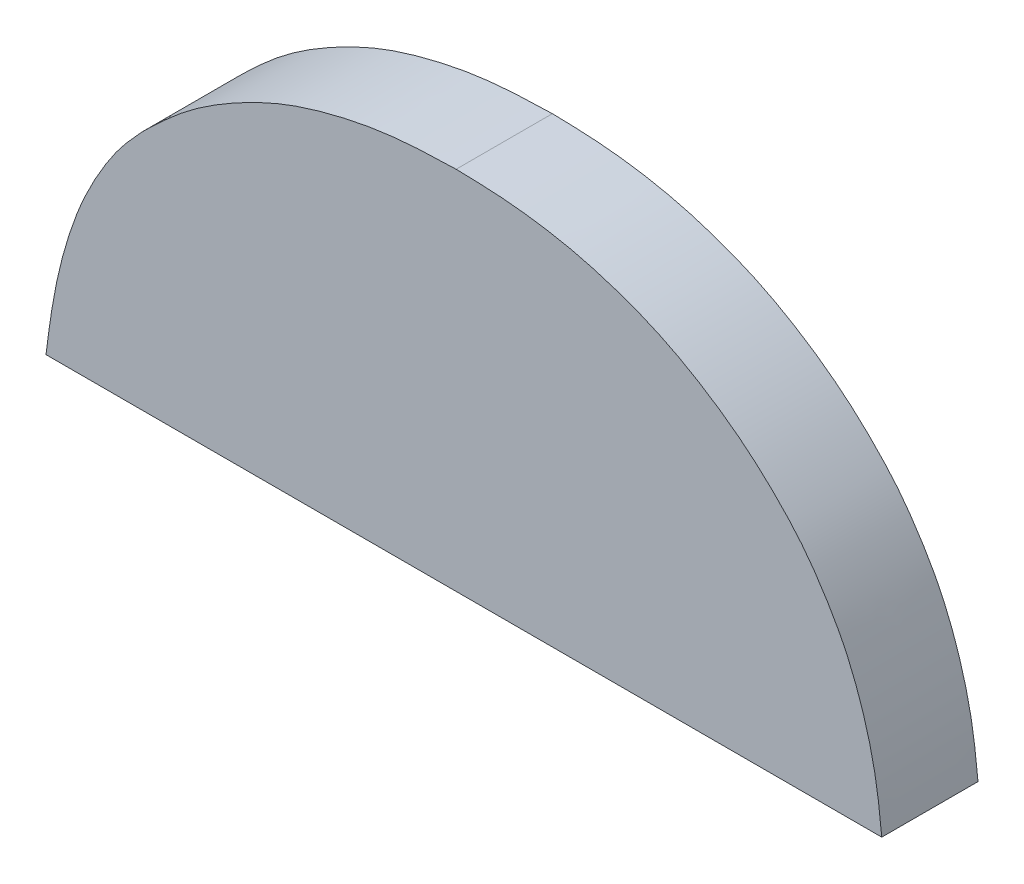
ISO-10303-21;
HEADER;
FILE_DESCRIPTION(('STEP AP214'),'2;1');
FILE_NAME('part.step','',(''),(''),'','','');
FILE_SCHEMA(('AUTOMOTIVE_DESIGN { 1 0 10303 214 1 1 1 1 }'));
ENDSEC;
DATA;
#1=APPLICATION_CONTEXT('core data for automotive mechanical design processes');
#2=APPLICATION_PROTOCOL_DEFINITION('international standard','automotive_design',2000,#1);
#3=PRODUCT_CONTEXT('',#1,'mechanical');
#4=PRODUCT('Part','Part','',(#3));
#5=PRODUCT_RELATED_PRODUCT_CATEGORY('part','',(#4));
#6=PRODUCT_DEFINITION_FORMATION('','',#4);
#7=PRODUCT_DEFINITION_CONTEXT('part definition',#1,'design');
#8=PRODUCT_DEFINITION('design','',#6,#7);
#9=PRODUCT_DEFINITION_SHAPE('','',#8);
#10=(LENGTH_UNIT() NAMED_UNIT(*) SI_UNIT(.MILLI.,.METRE.));
#11=(NAMED_UNIT(*) PLANE_ANGLE_UNIT() SI_UNIT($,.RADIAN.));
#12=(NAMED_UNIT(*) SI_UNIT($,.STERADIAN.) SOLID_ANGLE_UNIT());
#13=UNCERTAINTY_MEASURE_WITH_UNIT(LENGTH_MEASURE(1.E-05),#10,'distance_accuracy_value','');
#14=(GEOMETRIC_REPRESENTATION_CONTEXT(3) GLOBAL_UNCERTAINTY_ASSIGNED_CONTEXT((#13)) GLOBAL_UNIT_ASSIGNED_CONTEXT((#10,
#11,#12)) REPRESENTATION_CONTEXT('',''));
#15=CARTESIAN_POINT('',(0.,0.,0.));
#16=DIRECTION('',(0.,0.,1.));
#17=DIRECTION('',(1.,0.,0.));
#18=AXIS2_PLACEMENT_3D('',#15,#16,#17);
#19=CARTESIAN_POINT('',(-12.3042138671329,-1.03740541843096,-11.6632275560423));
#20=DIRECTION('',(0.,0.,1.));
#21=DIRECTION('',(0.,-1.,0.));
#22=AXIS2_PLACEMENT_3D('',#19,#20,#21);
#23=PLANE('',#22);
#24=DIRECTION('',(1.,0.,0.));
#25=VECTOR('',#24,1.);
#26=CARTESIAN_POINT('',(16.797592930269,-9.86319278697722,-11.6632275560423));
#27=LINE('',#26,#25);
#28=CARTESIAN_POINT('',(16.3460373747135,-9.86319278697722,-11.6632275560423));
#29=VERTEX_POINT('',#28);
#30=CARTESIAN_POINT('',(16.797592930269,-9.86319278697722,-11.6632275560423));
#31=VERTEX_POINT('',#30);
#32=EDGE_CURVE('E75',#29,#31,#27,.T.);
#33=ORIENTED_EDGE('',*,*,#32,.F.);
#34=CARTESIAN_POINT('',(16.3978516108246,-9.73310598142167,-11.6632275560423));
#35=CARTESIAN_POINT('',(16.3963477541903,-9.7347312519197,-11.6632275560423));
#36=CARTESIAN_POINT('',(16.3948403947072,-9.73635573284047,-11.6632275560423));
#37=CARTESIAN_POINT('',(16.3918687679316,-9.73964402485632,-11.6632275560423));
#38=CARTESIAN_POINT('',(16.3904045118469,-9.74130784598148,-11.6632275560423));
#39=CARTESIAN_POINT('',(16.3875725590429,-9.74471187617953,-11.6632275560423));
#40=CARTESIAN_POINT('',(16.3862046938479,-9.74645194289279,-11.6632275560423));
#41=CARTESIAN_POINT('',(16.3835689846794,-9.75000502055491,-11.6632275560423));
#42=CARTESIAN_POINT('',(16.3823011233229,-9.75181801874349,-11.6632275560423));
#43=CARTESIAN_POINT('',(16.3786402734566,-9.75729142783062,-11.6632275560423));
#44=CARTESIAN_POINT('',(16.3763583095054,-9.76102612217782,-11.6632275560423));
#45=CARTESIAN_POINT('',(16.3720515573308,-9.76864186706529,-11.6632275560423));
#46=CARTESIAN_POINT('',(16.3700268915956,-9.77252298618013,-11.6632275560423));
#47=CARTESIAN_POINT('',(16.365458035365,-9.78210313091849,-11.6632275560423));
#48=CARTESIAN_POINT('',(16.3630596632237,-9.78787261570379,-11.6632275560423));
#49=CARTESIAN_POINT('',(16.3588092982735,-9.79962760072538,-11.6632275560423));
#50=CARTESIAN_POINT('',(16.3569592284269,-9.80561378048643,-11.6632275560423));
#51=CARTESIAN_POINT('',(16.3541773372674,-9.81588688788045,-11.6632275560423));
#52=CARTESIAN_POINT('',(16.3531365091645,-9.82014521551532,-11.6632275560423));
#53=CARTESIAN_POINT('',(16.3512702106005,-9.82871041048724,-11.6632275560423));
#54=CARTESIAN_POINT('',(16.3504448028145,-9.8330172915712,-11.6632275560423));
#55=CARTESIAN_POINT('',(16.3489745698201,-9.84163103755771,-11.6632275560423));
#56=CARTESIAN_POINT('',(16.3483285821742,-9.84593771275958,-11.6632275560423));
#57=CARTESIAN_POINT('',(16.3471316269152,-9.85456077029746,-11.6632275560423));
#58=CARTESIAN_POINT('',(16.3465805781416,-9.85887714111453,-11.6632275560423));
#59=CARTESIAN_POINT('',(16.3460373747135,-9.86319278697722,-11.6632275560423));
#60=B_SPLINE_CURVE_WITH_KNOTS('',3,(#34,#35,#36,#37,#38,#39,#40,#41,#42,#43,#44,#45,#46,#47,#48,
#49,#50,#51,#52,#53,#54,#55,#56,#57,#58,#59),.UNSPECIFIED.,.F.,.F.,(4,2,2,2,2,2,2,2,2,2,2,2,4),
(0.,0.00664602968424741,0.0132937724962099,0.0199295921017872,0.0265642556925554,
0.0396812964362255,0.0528045584070677,0.0715151462265396,0.0902905982214406,0.103437192459347,
0.116587607347878,0.129650722007691,0.142702613389242),.UNSPECIFIED.);
#61=CARTESIAN_POINT('',(16.3978516108246,-9.73310598142167,-11.6632275560423));
#62=VERTEX_POINT('',#61);
#63=EDGE_CURVE('E67',#62,#29,#60,.T.);
#64=ORIENTED_EDGE('',*,*,#63,.F.);
#65=CARTESIAN_POINT('',(16.5676259163802,-9.66563723142166,-11.6632275560423));
#66=CARTESIAN_POINT('',(16.5632939716138,-9.66575048688524,-11.6632275560423));
#67=CARTESIAN_POINT('',(16.5589588774559,-9.66586469649818,-11.6632275560423));
#68=CARTESIAN_POINT('',(16.5502926464841,-9.66620584877957,-11.6632275560423));
#69=CARTESIAN_POINT('',(16.5459615107615,-9.6664328164518,-11.6632275560423));
#70=CARTESIAN_POINT('',(16.5372941710684,-9.66711202007369,-11.6632275560423));
#71=CARTESIAN_POINT('',(16.5329580465197,-9.66756535597326,-11.6632275560423));
#72=CARTESIAN_POINT('',(16.5243160480859,-9.66870745748117,-11.6632275560423));
#73=CARTESIAN_POINT('',(16.520010179235,-9.669396261365,-11.6632275560423));
#74=CARTESIAN_POINT('',(16.5095751988507,-9.67137681839585,-11.6632275560423));
#75=CARTESIAN_POINT('',(16.5034714299209,-9.67280052008504,-11.6632275560423));
#76=CARTESIAN_POINT('',(16.4913671415097,-9.6760369098774,-11.6632275560423));
#77=CARTESIAN_POINT('',(16.4853666092723,-9.67784954954501,-11.6632275560423));
#78=CARTESIAN_POINT('',(16.4677186640605,-9.6841877594558,-11.6632275560423));
#79=CARTESIAN_POINT('',(16.4563870507469,-9.68961902132921,-11.6632275560423));
#80=CARTESIAN_POINT('',(16.4411398402014,-9.69832006290796,-11.6632275560423));
#81=CARTESIAN_POINT('',(16.4368251208508,-9.70095189376335,-11.6632275560423));
#82=CARTESIAN_POINT('',(16.4284162934384,-9.70655379094297,-11.6632275560423));
#83=CARTESIAN_POINT('',(16.4243220577372,-9.70952365840638,-11.6632275560423));
#84=CARTESIAN_POINT('',(16.4164005906203,-9.71581977734417,-11.6632275560423));
#85=CARTESIAN_POINT('',(16.4125743124433,-9.71914720401966,-11.6632275560423));
#86=CARTESIAN_POINT('',(16.4051014614518,-9.72600870628252,-11.6632275560423));
#87=CARTESIAN_POINT('',(16.4014551001009,-9.72954301484333,-11.6632275560423));
#88=CARTESIAN_POINT('',(16.3978516108246,-9.73310598142167,-11.6632275560423));
#89=B_SPLINE_CURVE_WITH_KNOTS('',3,(#65,#66,#67,#68,#69,#70,#71,#72,#73,#74,#75,#76,#77,#78,#79,
#80,#81,#82,#83,#84,#85,#86,#87,#88),.UNSPECIFIED.,.F.,.F.,(4,2,2,2,2,2,2,2,2,2,2,4),(0.,
0.0130057656904838,0.0260144166613628,0.0390869024561724,0.052161514204227,0.0709484653085377,
0.0897330781769852,0.127189767401505,0.142349035509959,0.157499431342434,0.172701240606151,
0.187920511151363),.UNSPECIFIED.);
#90=CARTESIAN_POINT('',(16.5676259163802,-9.66563723142167,-11.6632275560423));
#91=VERTEX_POINT('',#90);
#92=EDGE_CURVE('E65',#91,#62,#89,.T.);
#93=ORIENTED_EDGE('',*,*,#92,.F.);
#94=CARTESIAN_POINT('',(16.797592930269,-9.86319278697722,-11.6632275560423));
#95=CARTESIAN_POINT('',(16.7972063050127,-9.85943014932584,-11.6632275560423));
#96=CARTESIAN_POINT('',(16.796817413455,-9.85566444384262,-11.6632275560423));
#97=CARTESIAN_POINT('',(16.7959319497222,-9.84814430814969,-11.6632275560423));
#98=CARTESIAN_POINT('',(16.7954353238267,-9.84438988451586,-11.6632275560423));
#99=CARTESIAN_POINT('',(16.794229937087,-9.83690428921082,-11.6632275560423));
#100=CARTESIAN_POINT('',(16.7935206552675,-9.83317319788367,-11.6632275560423));
#101=CARTESIAN_POINT('',(16.7919051506996,-9.82575579990788,-11.6632275560423));
#102=CARTESIAN_POINT('',(16.7909989643364,-9.82206948511786,-11.6632275560423));
#103=CARTESIAN_POINT('',(16.7880146997051,-9.81115585837549,-11.6632275560423));
#104=CARTESIAN_POINT('',(16.7856588689905,-9.80400114548184,-11.6632275560423));
#105=CARTESIAN_POINT('',(16.7815581557212,-9.79349572530355,-11.6632275560423));
#106=CARTESIAN_POINT('',(16.7800970001487,-9.79003216085986,-11.6632275560423));
#107=CARTESIAN_POINT('',(16.7769363166199,-9.78321594678435,-11.6632275560423));
#108=CARTESIAN_POINT('',(16.7752368876578,-9.77986325180144,-11.6632275560423));
#109=CARTESIAN_POINT('',(16.7707021109369,-9.77155606100451,-11.6632275560423));
#110=CARTESIAN_POINT('',(16.7677354496194,-9.76667471565899,-11.6632275560423));
#111=CARTESIAN_POINT('',(16.7614733195091,-9.7571234297758,-11.6632275560423));
#112=CARTESIAN_POINT('',(16.7581779629805,-9.75245341784514,-11.6632275560423));
#113=CARTESIAN_POINT('',(16.7510401216784,-9.7435499573471,-11.6632275560423));
#114=CARTESIAN_POINT('',(16.7471974806766,-9.73931663403423,-11.6632275560423));
#115=CARTESIAN_POINT('',(16.7392482072252,-9.73111165495241,-11.6632275560423));
#116=CARTESIAN_POINT('',(16.7351414566412,-9.72714011790963,-11.6632275560423));
#117=CARTESIAN_POINT('',(16.7266326342001,-9.71955861182955,-11.6632275560423));
#118=CARTESIAN_POINT('',(16.7222319275703,-9.71594714228861,-11.6632275560423));
#119=CARTESIAN_POINT('',(16.7131557445072,-9.70909857472102,-11.6632275560423));
#120=CARTESIAN_POINT('',(16.7084803047151,-9.70586142694117,-11.6632275560423));
#121=CARTESIAN_POINT('',(16.6941404552654,-9.69663148303097,-11.6632275560423));
#122=CARTESIAN_POINT('',(16.6841523904671,-9.69111155037846,-11.6632275560423));
#123=CARTESIAN_POINT('',(16.6681591155624,-9.68404733724281,-11.6632275560423));
#124=CARTESIAN_POINT('',(16.6624387913732,-9.68184302258364,-11.6632275560423));
#125=CARTESIAN_POINT('',(16.6508669427417,-9.67780848552621,-11.6632275560423));
#126=CARTESIAN_POINT('',(16.6450153598664,-9.67597843356115,-11.6632275560423));
#127=CARTESIAN_POINT('',(16.6272547543682,-9.67121451690638,-11.6632275560423));
#128=CARTESIAN_POINT('',(16.6151416557193,-9.66900769771332,-11.6632275560423));
#129=CARTESIAN_POINT('',(16.5970788550906,-9.66696746074119,-11.6632275560423));
#130=CARTESIAN_POINT('',(16.5911851056019,-9.66649678616109,-11.6632275560423));
#131=CARTESIAN_POINT('',(16.582341573093,-9.66605189263498,-11.6632275560423));
#132=CARTESIAN_POINT('',(16.5793984822198,-9.66594707037181,-11.6632275560423));
#133=CARTESIAN_POINT('',(16.5735119014663,-9.66577557855833,-11.6632275560423));
#134=CARTESIAN_POINT('',(16.5705684119225,-9.66570889844334,-11.6632275560423));
#135=CARTESIAN_POINT('',(16.5676259163802,-9.66563723142168,-11.6632275560423));
#136=B_SPLINE_CURVE_WITH_KNOTS('',3,(#94,#95,#96,#97,#98,#99,#100,#101,#102,#103,#104,#105,#106,
#107,#108,#109,#110,#111,#112,#113,#114,#115,#116,#117,#118,#119,#120,#121,#122,#123,#124,#125,
#126,#127,#128,#129,#130,#131,#132,#133,#134,#135),.UNSPECIFIED.,.F.,.F.,(4,2,2,2,2,2,2,2,2,2,2,
2,2,2,2,2,2,2,2,2,4),(0.,0.0113530117329507,0.0227116975693538,0.0340984410849273,
0.0454830822744292,0.0680322054098471,0.0793036223222102,0.0905703701560776,0.107692945675587,
0.124809692965113,0.141931336244286,0.15906069190647,0.176115386396528,0.193167811439758,
0.227232979665832,0.245605138327413,0.263985644836175,0.300752453771553,0.318483520726711,
0.327317679594776,0.336149390373574),.UNSPECIFIED.);
#137=EDGE_CURVE('E23',#31,#91,#136,.T.);
#138=ORIENTED_EDGE('',*,*,#137,.F.);
#139=EDGE_LOOP('',(#33,#64,#93,#138));
#140=FACE_BOUND('',#139,.T.);
#141=ADVANCED_FACE('F16',(#140),#23,.F.);
#142=CARTESIAN_POINT('',(16.797592930269,-9.86319278697722,-11.6112275560423));
#143=DIRECTION('',(0.,-1.,0.));
#144=DIRECTION('',(1.,0.,0.));
#145=AXIS2_PLACEMENT_3D('',#142,#143,#144);
#146=PLANE('',#145);
#147=DIRECTION('',(1.,0.,0.));
#148=VECTOR('',#147,1.);
#149=CARTESIAN_POINT('',(-12.3042138671329,-9.86319278697722,-11.6112275560423));
#150=LINE('',#149,#148);
#151=CARTESIAN_POINT('',(16.3460373747135,-9.86319278697722,-11.6112275560423));
#152=VERTEX_POINT('',#151);
#153=CARTESIAN_POINT('',(16.797592930269,-9.86319278697722,-11.6112275560423));
#154=VERTEX_POINT('',#153);
#155=EDGE_CURVE('E110',#152,#154,#150,.T.);
#156=ORIENTED_EDGE('',*,*,#155,.F.);
#157=DIRECTION('',(0.,0.,1.));
#158=VECTOR('',#157,1.);
#159=CARTESIAN_POINT('',(16.3460373747135,-9.86319278697722,-11.6372275560423));
#160=LINE('',#159,#158);
#161=EDGE_CURVE('E80',#29,#152,#160,.T.);
#162=ORIENTED_EDGE('',*,*,#161,.F.);
#163=ORIENTED_EDGE('',*,*,#32,.T.);
#164=DIRECTION('',(0.,0.,-1.));
#165=VECTOR('',#164,1.);
#166=CARTESIAN_POINT('',(16.797592930269,-9.86319278697722,-11.6372275560423));
#167=LINE('',#166,#165);
#168=EDGE_CURVE('E70',#154,#31,#167,.T.);
#169=ORIENTED_EDGE('',*,*,#168,.F.);
#170=EDGE_LOOP('',(#156,#162,#163,#169));
#171=FACE_BOUND('',#170,.T.);
#172=ADVANCED_FACE('F102',(#171),#146,.T.);
#173=CARTESIAN_POINT('',(16.5676259163802,-9.66563723142168,-11.6112275560423));
#174=CARTESIAN_POINT('',(16.5676259163802,-9.66563723142168,-11.6285608893756));
#175=CARTESIAN_POINT('',(16.5676259163802,-9.66563723142168,-11.645894222709));
#176=CARTESIAN_POINT('',(16.5676259163802,-9.66563723142168,-11.6632275560423));
#177=CARTESIAN_POINT('',(16.5753494594637,-9.66581658850398,-11.6112275560423));
#178=CARTESIAN_POINT('',(16.5753494594637,-9.66581658850398,-11.6285608893756));
#179=CARTESIAN_POINT('',(16.5753494594637,-9.66581658850398,-11.645894222709));
#180=CARTESIAN_POINT('',(16.5753494594637,-9.66581658850398,-11.6632275560423));
#181=CARTESIAN_POINT('',(16.5904677625065,-9.66616766762574,-11.6112275560423));
#182=CARTESIAN_POINT('',(16.5904677625065,-9.66616766762574,-11.6285608893756));
#183=CARTESIAN_POINT('',(16.5904677625065,-9.66616766762574,-11.645894222709));
#184=CARTESIAN_POINT('',(16.5904677625065,-9.66616766762574,-11.6632275560423));
#185=CARTESIAN_POINT('',(16.612740349998,-9.66863820846812,-11.6112275560423));
#186=CARTESIAN_POINT('',(16.612740349998,-9.66863820846812,-11.6285608893756));
#187=CARTESIAN_POINT('',(16.612740349998,-9.66863820846812,-11.645894222709));
#188=CARTESIAN_POINT('',(16.612740349998,-9.66863820846812,-11.6632275560423));
#189=CARTESIAN_POINT('',(16.6340872057585,-9.67273373120656,-11.6112275560423));
#190=CARTESIAN_POINT('',(16.6340872057585,-9.67273373120656,-11.6285608893756));
#191=CARTESIAN_POINT('',(16.6340872057585,-9.67273373120656,-11.645894222709));
#192=CARTESIAN_POINT('',(16.6340872057585,-9.67273373120656,-11.6632275560423));
#193=CARTESIAN_POINT('',(16.6544704888416,-9.67881031037744,-11.6112275560423));
#194=CARTESIAN_POINT('',(16.6544704888416,-9.67881031037744,-11.6285608893756));
#195=CARTESIAN_POINT('',(16.6544704888416,-9.67881031037744,-11.645894222709));
#196=CARTESIAN_POINT('',(16.6544704888416,-9.67881031037744,-11.6632275560423));
#197=CARTESIAN_POINT('',(16.6739646533731,-9.68619567211636,-11.6112275560423));
#198=CARTESIAN_POINT('',(16.6739646533731,-9.68619567211636,-11.6285608893756));
#199=CARTESIAN_POINT('',(16.6739646533731,-9.68619567211636,-11.645894222709));
#200=CARTESIAN_POINT('',(16.6739646533731,-9.68619567211636,-11.6632275560423));
#201=CARTESIAN_POINT('',(16.692432629807,-9.69563644433889,-11.6112275560423));
#202=CARTESIAN_POINT('',(16.692432629807,-9.69563644433889,-11.6285608893756));
#203=CARTESIAN_POINT('',(16.692432629807,-9.69563644433889,-11.645894222709));
#204=CARTESIAN_POINT('',(16.692432629807,-9.69563644433889,-11.6632275560423));
#205=CARTESIAN_POINT('',(16.7100036905485,-9.70660629346262,-11.6112275560423));
#206=CARTESIAN_POINT('',(16.7100036905485,-9.70660629346262,-11.6285608893756));
#207=CARTESIAN_POINT('',(16.7100036905485,-9.70660629346262,-11.645894222709));
#208=CARTESIAN_POINT('',(16.7100036905485,-9.70660629346262,-11.6632275560423));
#209=CARTESIAN_POINT('',(16.7266078503553,-9.71915430948713,-11.6112275560423));
#210=CARTESIAN_POINT('',(16.7266078503553,-9.71915430948713,-11.6285608893756));
#211=CARTESIAN_POINT('',(16.7266078503553,-9.71915430948713,-11.645894222709));
#212=CARTESIAN_POINT('',(16.7266078503553,-9.71915430948713,-11.6632275560423));
#213=CARTESIAN_POINT('',(16.7416285007812,-9.73321667283253,-11.6112275560423));
#214=CARTESIAN_POINT('',(16.7416285007812,-9.73321667283253,-11.6285608893756));
#215=CARTESIAN_POINT('',(16.7416285007812,-9.73321667283253,-11.645894222709));
#216=CARTESIAN_POINT('',(16.7416285007812,-9.73321667283253,-11.6632275560423));
#217=CARTESIAN_POINT('',(16.7553650812465,-9.74819621851415,-11.6112275560423));
#218=CARTESIAN_POINT('',(16.7553650812465,-9.74819621851415,-11.6285608893756));
#219=CARTESIAN_POINT('',(16.7553650812465,-9.74819621851415,-11.645894222709));
#220=CARTESIAN_POINT('',(16.7553650812465,-9.74819621851415,-11.6632275560423));
#221=CARTESIAN_POINT('',(16.7667375937357,-9.76475205162929,-11.6112275560423));
#222=CARTESIAN_POINT('',(16.7667375937357,-9.76475205162929,-11.6285608893756));
#223=CARTESIAN_POINT('',(16.7667375937357,-9.76475205162929,-11.645894222709));
#224=CARTESIAN_POINT('',(16.7667375937357,-9.76475205162929,-11.6632275560423));
#225=CARTESIAN_POINT('',(16.7768210432233,-9.7821127793161,-11.6112275560423));
#226=CARTESIAN_POINT('',(16.7768210432233,-9.7821127793161,-11.6285608893756));
#227=CARTESIAN_POINT('',(16.7768210432233,-9.7821127793161,-11.645894222709));
#228=CARTESIAN_POINT('',(16.7768210432233,-9.7821127793161,-11.6632275560423));
#229=CARTESIAN_POINT('',(16.7847164523801,-9.80082020607862,-11.6112275560423));
#230=CARTESIAN_POINT('',(16.7847164523801,-9.80082020607862,-11.6285608893756));
#231=CARTESIAN_POINT('',(16.7847164523801,-9.80082020607862,-11.645894222709));
#232=CARTESIAN_POINT('',(16.7847164523801,-9.80082020607862,-11.6632275560423));
#233=CARTESIAN_POINT('',(16.790932066499,-9.82059874831652,-11.6112275560423));
#234=CARTESIAN_POINT('',(16.790932066499,-9.82059874831652,-11.6285608893756));
#235=CARTESIAN_POINT('',(16.790932066499,-9.82059874831652,-11.645894222709));
#236=CARTESIAN_POINT('',(16.790932066499,-9.82059874831652,-11.6632275560423));
#237=CARTESIAN_POINT('',(16.7953566136737,-9.8415029147825,-11.6112275560423));
#238=CARTESIAN_POINT('',(16.7953566136737,-9.8415029147825,-11.6285608893756));
#239=CARTESIAN_POINT('',(16.7953566136737,-9.8415029147825,-11.645894222709));
#240=CARTESIAN_POINT('',(16.7953566136737,-9.8415029147825,-11.6632275560423));
#241=CARTESIAN_POINT('',(16.7968408493316,-9.8558984086017,-11.6112275560423));
#242=CARTESIAN_POINT('',(16.7968408493316,-9.8558984086017,-11.6285608893756));
#243=CARTESIAN_POINT('',(16.7968408493316,-9.8558984086017,-11.645894222709));
#244=CARTESIAN_POINT('',(16.7968408493316,-9.8558984086017,-11.6632275560423));
#245=CARTESIAN_POINT('',(16.797592930269,-9.86319278697722,-11.6112275560423));
#246=CARTESIAN_POINT('',(16.797592930269,-9.86319278697722,-11.6285608893756));
#247=CARTESIAN_POINT('',(16.797592930269,-9.86319278697722,-11.645894222709));
#248=CARTESIAN_POINT('',(16.797592930269,-9.86319278697722,-11.6632275560423));
#249=B_SPLINE_SURFACE_WITH_KNOTS('',3,3,((#173,#174,#175,#176),(#177,#178,#179,#180),(#181,#182,
#183,#184),(#185,#186,#187,#188),(#189,#190,#191,#192),(#193,#194,#195,#196),(#197,#198,#199,
#200),(#201,#202,#203,#204),(#205,#206,#207,#208),(#209,#210,#211,#212),(#213,#214,#215,#216),
(#217,#218,#219,#220),(#221,#222,#223,#224),(#225,#226,#227,#228),(#229,#230,#231,#232),(#233,
#234,#235,#236),(#237,#238,#239,#240),(#241,#242,#243,#244),(#245,#246,#247,#248)),
.UNSPECIFIED.,.F.,.F.,.F.,(4,1,1,1,1,1,1,1,1,1,1,1,1,1,1,1,4),(4,4),(0.,0.0689192924954854,
0.134904763031075,0.199735937218572,0.262623568302118,0.324500904453406,0.385513564146934,
0.44739090029825,0.509177787717324,0.570905463922605,0.630822424685677,0.690144079489098,
0.749776756500746,0.809718841937706,0.870914554102543,0.934590775629306,1.),(0.,1.),.UNSPECIFIED.);
#250=CARTESIAN_POINT('',(16.797592930269,-9.86319278697722,-11.6112275560423));
#251=CARTESIAN_POINT('',(16.7972063050127,-9.85943014932583,-11.6112275560423));
#252=CARTESIAN_POINT('',(16.796817413455,-9.85566444384262,-11.6112275560423));
#253=CARTESIAN_POINT('',(16.7959319497222,-9.84814430814968,-11.6112275560423));
#254=CARTESIAN_POINT('',(16.7954353238267,-9.84438988451586,-11.6112275560423));
#255=CARTESIAN_POINT('',(16.794229937087,-9.83690428921082,-11.6112275560423));
#256=CARTESIAN_POINT('',(16.7935206552675,-9.83317319788366,-11.6112275560423));
#257=CARTESIAN_POINT('',(16.7919051506996,-9.82575579990788,-11.6112275560423));
#258=CARTESIAN_POINT('',(16.7909989643364,-9.82206948511786,-11.6112275560423));
#259=CARTESIAN_POINT('',(16.7880146997051,-9.81115585837548,-11.6112275560423));
#260=CARTESIAN_POINT('',(16.7856588689906,-9.80400114548184,-11.6112275560423));
#261=CARTESIAN_POINT('',(16.7815581557212,-9.79349572530355,-11.6112275560423));
#262=CARTESIAN_POINT('',(16.7800970001487,-9.79003216085986,-11.6112275560423));
#263=CARTESIAN_POINT('',(16.7769363166199,-9.78321594678435,-11.6112275560423));
#264=CARTESIAN_POINT('',(16.7752368876578,-9.77986325180144,-11.6112275560423));
#265=CARTESIAN_POINT('',(16.7707021109369,-9.77155606100451,-11.6112275560423));
#266=CARTESIAN_POINT('',(16.7677354496194,-9.76667471565899,-11.6112275560423));
#267=CARTESIAN_POINT('',(16.7614733195091,-9.7571234297758,-11.6112275560423));
#268=CARTESIAN_POINT('',(16.7581779629805,-9.75245341784514,-11.6112275560423));
#269=CARTESIAN_POINT('',(16.7510401216784,-9.7435499573471,-11.6112275560423));
#270=CARTESIAN_POINT('',(16.7471974806766,-9.73931663403423,-11.6112275560423));
#271=CARTESIAN_POINT('',(16.7392482072252,-9.73111165495241,-11.6112275560423));
#272=CARTESIAN_POINT('',(16.7351414566412,-9.72714011790963,-11.6112275560423));
#273=CARTESIAN_POINT('',(16.7266326342001,-9.71955861182955,-11.6112275560423));
#274=CARTESIAN_POINT('',(16.7222319275703,-9.71594714228861,-11.6112275560423));
#275=CARTESIAN_POINT('',(16.7131557445072,-9.70909857472102,-11.6112275560423));
#276=CARTESIAN_POINT('',(16.7084803047151,-9.70586142694117,-11.6112275560423));
#277=CARTESIAN_POINT('',(16.6941404552654,-9.69663148303097,-11.6112275560423));
#278=CARTESIAN_POINT('',(16.6841523904671,-9.69111155037846,-11.6112275560423));
#279=CARTESIAN_POINT('',(16.6681591155624,-9.68404733724281,-11.6112275560423));
#280=CARTESIAN_POINT('',(16.6624387913732,-9.68184302258364,-11.6112275560423));
#281=CARTESIAN_POINT('',(16.6508669427417,-9.6778084855262,-11.6112275560423));
#282=CARTESIAN_POINT('',(16.6450153598664,-9.67597843356114,-11.6112275560423));
#283=CARTESIAN_POINT('',(16.6272547543681,-9.67121451690636,-11.6112275560423));
#284=CARTESIAN_POINT('',(16.6151416557192,-9.6690076977133,-11.6112275560423));
#285=CARTESIAN_POINT('',(16.5970788550905,-9.66696746074118,-11.6112275560423));
#286=CARTESIAN_POINT('',(16.5911851056018,-9.66649678616109,-11.6112275560423));
#287=CARTESIAN_POINT('',(16.5823415730929,-9.66605189263498,-11.6112275560423));
#288=CARTESIAN_POINT('',(16.5793984822198,-9.66594707037181,-11.6112275560423));
#289=CARTESIAN_POINT('',(16.5735119014663,-9.66577557855833,-11.6112275560423));
#290=CARTESIAN_POINT('',(16.5705684119225,-9.66570889844333,-11.6112275560423));
#291=CARTESIAN_POINT('',(16.5676259163802,-9.66563723142168,-11.6112275560423));
#292=B_SPLINE_CURVE_WITH_KNOTS('',3,(#250,#251,#252,#253,#254,#255,#256,#257,#258,#259,#260,
#261,#262,#263,#264,#265,#266,#267,#268,#269,#270,#271,#272,#273,#274,#275,#276,#277,#278,#279,
#280,#281,#282,#283,#284,#285,#286,#287,#288,#289,#290,#291),.UNSPECIFIED.,.F.,.F.,(4,2,2,2,2,2,
2,2,2,2,2,2,2,2,2,2,2,2,2,2,4),(0.,0.0113530117329521,0.0227116975693561,0.0340984410849289,
0.0454830822744308,0.0680322054098476,0.0793036223222135,0.0905703701560762,0.107692945675584,
0.124809692965112,0.141931336244287,0.159060691906472,0.176115386396528,0.193167811439756,
0.227232979665824,0.245605138327431,0.263985644836229,0.300752453771671,0.318483520726766,
0.327317679594803,0.336149390373574),.UNSPECIFIED.);
#293=CARTESIAN_POINT('',(16.5676259163802,-9.66563723142166,-11.6112275560423));
#294=VERTEX_POINT('',#293);
#295=EDGE_CURVE('E105',#154,#294,#292,.T.);
#296=DIRECTION('',(0.,0.,-1.));
#297=VECTOR('',#296,1.);
#298=CARTESIAN_POINT('',(16.5676259163802,-9.66563723142166,-11.6372275560423));
#299=LINE('',#298,#297);
#300=EDGE_CURVE('E69',#294,#91,#299,.T.);
#301=ORIENTED_EDGE('',*,*,#295,.F.);
#302=ORIENTED_EDGE('',*,*,#168,.T.);
#303=ORIENTED_EDGE('',*,*,#137,.T.);
#304=ORIENTED_EDGE('',*,*,#300,.F.);
#305=EDGE_LOOP('',(#301,#302,#303,#304));
#306=FACE_BOUND('',#305,.T.);
#307=ADVANCED_FACE('F74',(#306),#249,.T.);
#308=CARTESIAN_POINT('',(16.3978516108246,-9.73310598142167,-11.6112275560423));
#309=CARTESIAN_POINT('',(16.3978516108246,-9.73310598142167,-11.6285608893756));
#310=CARTESIAN_POINT('',(16.3978516108246,-9.73310598142167,-11.645894222709));
#311=CARTESIAN_POINT('',(16.3978516108246,-9.73310598142167,-11.6632275560423));
#312=CARTESIAN_POINT('',(16.4033999879777,-9.72769058877101,-11.6112275560423));
#313=CARTESIAN_POINT('',(16.4033999879777,-9.72769058877101,-11.6285608893756));
#314=CARTESIAN_POINT('',(16.4033999879777,-9.72769058877101,-11.645894222709));
#315=CARTESIAN_POINT('',(16.4033999879777,-9.72769058877101,-11.6632275560423));
#316=CARTESIAN_POINT('',(16.4143589812231,-9.71699426264852,-11.6112275560423));
#317=CARTESIAN_POINT('',(16.4143589812231,-9.71699426264852,-11.6285608893756));
#318=CARTESIAN_POINT('',(16.4143589812231,-9.71699426264852,-11.645894222709));
#319=CARTESIAN_POINT('',(16.4143589812231,-9.71699426264852,-11.6632275560423));
#320=CARTESIAN_POINT('',(16.4326305892602,-9.70320601392073,-11.6112275560423));
#321=CARTESIAN_POINT('',(16.4326305892602,-9.70320601392073,-11.6285608893756));
#322=CARTESIAN_POINT('',(16.4326305892602,-9.70320601392073,-11.645894222709));
#323=CARTESIAN_POINT('',(16.4326305892602,-9.70320601392073,-11.6632275560423));
#324=CARTESIAN_POINT('',(16.4522671716778,-9.69177158481189,-11.6112275560423));
#325=CARTESIAN_POINT('',(16.4522671716778,-9.69177158481189,-11.6285608893756));
#326=CARTESIAN_POINT('',(16.4522671716778,-9.69177158481189,-11.645894222709));
#327=CARTESIAN_POINT('',(16.4522671716778,-9.69177158481189,-11.6632275560423));
#328=CARTESIAN_POINT('',(16.4728869697448,-9.68190577514599,-11.6112275560423));
#329=CARTESIAN_POINT('',(16.4728869697448,-9.68190577514599,-11.6285608893756));
#330=CARTESIAN_POINT('',(16.4728869697448,-9.68190577514599,-11.645894222709));
#331=CARTESIAN_POINT('',(16.4728869697448,-9.68190577514599,-11.6632275560423));
#332=CARTESIAN_POINT('',(16.4949511926324,-9.67475825452484,-11.6112275560423));
#333=CARTESIAN_POINT('',(16.4949511926324,-9.67475825452484,-11.6285608893756));
#334=CARTESIAN_POINT('',(16.4949511926324,-9.67475825452484,-11.645894222709));
#335=CARTESIAN_POINT('',(16.4949511926324,-9.67475825452484,-11.6632275560423));
#336=CARTESIAN_POINT('',(16.518018083203,-9.66935871726529,-11.6112275560423));
#337=CARTESIAN_POINT('',(16.518018083203,-9.66935871726529,-11.6285608893756));
#338=CARTESIAN_POINT('',(16.518018083203,-9.66935871726529,-11.645894222709));
#339=CARTESIAN_POINT('',(16.518018083203,-9.66935871726529,-11.6632275560423));
#340=CARTESIAN_POINT('',(16.5424087377623,-9.66629997269214,-11.6112275560423));
#341=CARTESIAN_POINT('',(16.5424087377623,-9.66629997269214,-11.6285608893756));
#342=CARTESIAN_POINT('',(16.5424087377623,-9.66629997269214,-11.645894222709));
#343=CARTESIAN_POINT('',(16.5424087377623,-9.66629997269214,-11.6632275560423));
#344=CARTESIAN_POINT('',(16.5590922953324,-9.66586150642646,-11.6112275560423));
#345=CARTESIAN_POINT('',(16.5590922953324,-9.66586150642646,-11.6285608893756));
#346=CARTESIAN_POINT('',(16.5590922953324,-9.66586150642646,-11.645894222709));
#347=CARTESIAN_POINT('',(16.5590922953324,-9.66586150642646,-11.6632275560423));
#348=CARTESIAN_POINT('',(16.5676259163802,-9.66563723142166,-11.6112275560423));
#349=CARTESIAN_POINT('',(16.5676259163802,-9.66563723142166,-11.6285608893756));
#350=CARTESIAN_POINT('',(16.5676259163802,-9.66563723142166,-11.645894222709));
#351=CARTESIAN_POINT('',(16.5676259163802,-9.66563723142166,-11.6632275560423));
#352=B_SPLINE_SURFACE_WITH_KNOTS('',3,3,((#308,#309,#310,#311),(#312,#313,#314,#315),(#316,#317,
#318,#319),(#320,#321,#322,#323),(#324,#325,#326,#327),(#328,#329,#330,#331),(#332,#333,#334,
#335),(#336,#337,#338,#339),(#340,#341,#342,#343),(#344,#345,#346,#347),(#348,#349,#350,#351)),
.UNSPECIFIED.,.F.,.F.,.F.,(4,1,1,1,1,1,1,1,4),(4,4),(0.,0.123685845875445,0.244300686868343,
0.364228779969847,0.486002204276861,0.608440784856463,0.73366961815829,0.863772307399149,1.),
(0.,1.),.UNSPECIFIED.);
#353=CARTESIAN_POINT('',(16.5676259163802,-9.66563723142166,-11.6112275560423));
#354=CARTESIAN_POINT('',(16.5632939716138,-9.66575048688524,-11.6112275560423));
#355=CARTESIAN_POINT('',(16.5589588774559,-9.66586469649818,-11.6112275560423));
#356=CARTESIAN_POINT('',(16.5502926464841,-9.66620584877957,-11.6112275560423));
#357=CARTESIAN_POINT('',(16.5459615107615,-9.66643281645181,-11.6112275560423));
#358=CARTESIAN_POINT('',(16.5372941710684,-9.6671120200737,-11.6112275560423));
#359=CARTESIAN_POINT('',(16.5329580465197,-9.66756535597326,-11.6112275560423));
#360=CARTESIAN_POINT('',(16.5243160480859,-9.66870745748117,-11.6112275560423));
#361=CARTESIAN_POINT('',(16.520010179235,-9.669396261365,-11.6112275560423));
#362=CARTESIAN_POINT('',(16.5095751988507,-9.67137681839585,-11.6112275560423));
#363=CARTESIAN_POINT('',(16.503471429921,-9.67280052008504,-11.6112275560423));
#364=CARTESIAN_POINT('',(16.4913671415097,-9.67603690987739,-11.6112275560423));
#365=CARTESIAN_POINT('',(16.4853666092723,-9.67784954954501,-11.6112275560423));
#366=CARTESIAN_POINT('',(16.4677186640605,-9.6841877594558,-11.6112275560423));
#367=CARTESIAN_POINT('',(16.4563870507469,-9.6896190213292,-11.6112275560423));
#368=CARTESIAN_POINT('',(16.4411398402014,-9.69832006290796,-11.6112275560423));
#369=CARTESIAN_POINT('',(16.4368251208508,-9.70095189376334,-11.6112275560423));
#370=CARTESIAN_POINT('',(16.4284162934384,-9.70655379094297,-11.6112275560423));
#371=CARTESIAN_POINT('',(16.4243220577372,-9.70952365840638,-11.6112275560423));
#372=CARTESIAN_POINT('',(16.4164005906203,-9.71581977734417,-11.6112275560423));
#373=CARTESIAN_POINT('',(16.4125743124433,-9.71914720401966,-11.6112275560423));
#374=CARTESIAN_POINT('',(16.4051014614518,-9.72600870628251,-11.6112275560423));
#375=CARTESIAN_POINT('',(16.4014551001009,-9.72954301484332,-11.6112275560423));
#376=CARTESIAN_POINT('',(16.3978516108246,-9.73310598142167,-11.6112275560423));
#377=B_SPLINE_CURVE_WITH_KNOTS('',3,(#353,#354,#355,#356,#357,#358,#359,#360,#361,#362,#363,
#364,#365,#366,#367,#368,#369,#370,#371,#372,#373,#374,#375,#376),.UNSPECIFIED.,.F.,.F.,(4,2,2,
2,2,2,2,2,2,2,2,4),(0.,0.0130057656904838,0.0260144166613594,0.0390869024561692,
0.0521615142042196,0.0709484653085294,0.0897330781769703,0.127189767401488,0.142349035509943,
0.157499431342425,0.172701240606144,0.187920511151363),.UNSPECIFIED.);
#378=CARTESIAN_POINT('',(16.3978516108246,-9.73310598142167,-11.6112275560423));
#379=VERTEX_POINT('',#378);
#380=EDGE_CURVE('E35',#294,#379,#377,.T.);
#381=DIRECTION('',(0.,0.,-1.));
#382=VECTOR('',#381,1.);
#383=CARTESIAN_POINT('',(16.3978516108246,-9.73310598142167,-11.6372275560423));
#384=LINE('',#383,#382);
#385=EDGE_CURVE('E44',#379,#62,#384,.T.);
#386=ORIENTED_EDGE('',*,*,#380,.F.);
#387=ORIENTED_EDGE('',*,*,#300,.T.);
#388=ORIENTED_EDGE('',*,*,#92,.T.);
#389=ORIENTED_EDGE('',*,*,#385,.F.);
#390=EDGE_LOOP('',(#386,#387,#388,#389));
#391=FACE_BOUND('',#390,.T.);
#392=ADVANCED_FACE('F76',(#391),#352,.T.);
#393=CARTESIAN_POINT('',(16.3460373747135,-9.86319278697722,-11.6112275560423));
#394=CARTESIAN_POINT('',(16.3460373747135,-9.86319278697722,-11.6285608893756));
#395=CARTESIAN_POINT('',(16.3460373747135,-9.86319278697722,-11.645894222709));
#396=CARTESIAN_POINT('',(16.3460373747135,-9.86319278697722,-11.6632275560423));
#397=CARTESIAN_POINT('',(16.3469256326592,-9.85620121538665,-11.6112275560423));
#398=CARTESIAN_POINT('',(16.3469256326592,-9.85620121538665,-11.6285608893756));
#399=CARTESIAN_POINT('',(16.3469256326592,-9.85620121538665,-11.645894222709));
#400=CARTESIAN_POINT('',(16.3469256326592,-9.85620121538665,-11.6632275560423));
#401=CARTESIAN_POINT('',(16.3486623712669,-9.84253116338469,-11.6112275560423));
#402=CARTESIAN_POINT('',(16.3486623712669,-9.84253116338469,-11.6285608893756));
#403=CARTESIAN_POINT('',(16.3486623712669,-9.84253116338469,-11.645894222709));
#404=CARTESIAN_POINT('',(16.3486623712669,-9.84253116338469,-11.6632275560423));
#405=CARTESIAN_POINT('',(16.3523179268157,-9.82275914126582,-11.6112275560423));
#406=CARTESIAN_POINT('',(16.3523179268157,-9.82275914126582,-11.6285608893756));
#407=CARTESIAN_POINT('',(16.3523179268157,-9.82275914126582,-11.645894222709));
#408=CARTESIAN_POINT('',(16.3523179268157,-9.82275914126582,-11.6632275560423));
#409=CARTESIAN_POINT('',(16.3571932752716,-9.80433770096691,-11.6112275560423));
#410=CARTESIAN_POINT('',(16.3571932752716,-9.80433770096691,-11.6285608893756));
#411=CARTESIAN_POINT('',(16.3571932752716,-9.80433770096691,-11.645894222709));
#412=CARTESIAN_POINT('',(16.3571932752716,-9.80433770096691,-11.6632275560423));
#413=CARTESIAN_POINT('',(16.363064885464,-9.78733603389245,-11.6112275560423));
#414=CARTESIAN_POINT('',(16.363064885464,-9.78733603389245,-11.6285608893756));
#415=CARTESIAN_POINT('',(16.363064885464,-9.78733603389245,-11.645894222709));
#416=CARTESIAN_POINT('',(16.363064885464,-9.78733603389245,-11.6632275560423));
#417=CARTESIAN_POINT('',(16.3702249154458,-9.77172159173004,-11.6112275560423));
#418=CARTESIAN_POINT('',(16.3702249154458,-9.77172159173004,-11.6285608893756));
#419=CARTESIAN_POINT('',(16.3702249154458,-9.77172159173004,-11.645894222709));
#420=CARTESIAN_POINT('',(16.3702249154458,-9.77172159173004,-11.6632275560423));
#421=CARTESIAN_POINT('',(16.3783145832169,-9.7574704158782,-11.6112275560423));
#422=CARTESIAN_POINT('',(16.3783145832169,-9.7574704158782,-11.6285608893756));
#423=CARTESIAN_POINT('',(16.3783145832169,-9.7574704158782,-11.645894222709));
#424=CARTESIAN_POINT('',(16.3783145832169,-9.7574704158782,-11.6632275560423));
#425=CARTESIAN_POINT('',(16.3873537710046,-9.74443031302861,-11.6112275560423));
#426=CARTESIAN_POINT('',(16.3873537710046,-9.74443031302861,-11.6285608893756));
#427=CARTESIAN_POINT('',(16.3873537710046,-9.74443031302861,-11.645894222709));
#428=CARTESIAN_POINT('',(16.3873537710046,-9.74443031302861,-11.6632275560423));
#429=CARTESIAN_POINT('',(16.3943790396372,-9.73685194709934,-11.6112275560423));
#430=CARTESIAN_POINT('',(16.3943790396372,-9.73685194709934,-11.6285608893756));
#431=CARTESIAN_POINT('',(16.3943790396372,-9.73685194709934,-11.645894222709));
#432=CARTESIAN_POINT('',(16.3943790396372,-9.73685194709934,-11.6632275560423));
#433=CARTESIAN_POINT('',(16.3978516108246,-9.73310598142167,-11.6112275560423));
#434=CARTESIAN_POINT('',(16.3978516108246,-9.73310598142167,-11.6285608893756));
#435=CARTESIAN_POINT('',(16.3978516108246,-9.73310598142167,-11.645894222709));
#436=CARTESIAN_POINT('',(16.3978516108246,-9.73310598142167,-11.6632275560423));
#437=B_SPLINE_SURFACE_WITH_KNOTS('',3,3,((#393,#394,#395,#396),(#397,#398,#399,#400),(#401,#402,
#403,#404),(#405,#406,#407,#408),(#409,#410,#411,#412),(#413,#414,#415,#416),(#417,#418,#419,
#420),(#421,#422,#423,#424),(#425,#426,#427,#428),(#429,#430,#431,#432),(#433,#434,#435,#436)),
.UNSPECIFIED.,.F.,.F.,.F.,(4,1,1,1,1,1,1,1,4),(4,4),(0.,0.148164531586459,0.289694073127111,
0.422376717853943,0.548461855840514,0.667394076398954,0.782966237335713,0.892720801104233,1.),
(0.,1.),.UNSPECIFIED.);
#438=CARTESIAN_POINT('',(16.3978516108246,-9.73310598142167,-11.6112275560423));
#439=CARTESIAN_POINT('',(16.3963477541903,-9.7347312519197,-11.6112275560423));
#440=CARTESIAN_POINT('',(16.3948403947072,-9.73635573284047,-11.6112275560423));
#441=CARTESIAN_POINT('',(16.3918687679316,-9.73964402485631,-11.6112275560423));
#442=CARTESIAN_POINT('',(16.3904045118469,-9.74130784598147,-11.6112275560423));
#443=CARTESIAN_POINT('',(16.3875725590429,-9.74471187617953,-11.6112275560423));
#444=CARTESIAN_POINT('',(16.3862046938479,-9.74645194289279,-11.6112275560423));
#445=CARTESIAN_POINT('',(16.3835689846794,-9.75000502055492,-11.6112275560423));
#446=CARTESIAN_POINT('',(16.3823011233229,-9.75181801874349,-11.6112275560423));
#447=CARTESIAN_POINT('',(16.3786402734566,-9.75729142783062,-11.6112275560423));
#448=CARTESIAN_POINT('',(16.3763583095054,-9.76102612217782,-11.6112275560423));
#449=CARTESIAN_POINT('',(16.3720515573308,-9.76864186706529,-11.6112275560423));
#450=CARTESIAN_POINT('',(16.3700268915956,-9.77252298618013,-11.6112275560423));
#451=CARTESIAN_POINT('',(16.365458035365,-9.78210313091849,-11.6112275560423));
#452=CARTESIAN_POINT('',(16.3630596632237,-9.78787261570379,-11.6112275560423));
#453=CARTESIAN_POINT('',(16.3588092982735,-9.79962760072538,-11.6112275560423));
#454=CARTESIAN_POINT('',(16.3569592284269,-9.80561378048643,-11.6112275560423));
#455=CARTESIAN_POINT('',(16.3541773372674,-9.81588688788045,-11.6112275560423));
#456=CARTESIAN_POINT('',(16.3531365091644,-9.82014521551531,-11.6112275560423));
#457=CARTESIAN_POINT('',(16.3512702106005,-9.82871041048724,-11.6112275560423));
#458=CARTESIAN_POINT('',(16.3504448028145,-9.8330172915712,-11.6112275560423));
#459=CARTESIAN_POINT('',(16.3489745698201,-9.84163103755771,-11.6112275560423));
#460=CARTESIAN_POINT('',(16.3483285821742,-9.84593771275958,-11.6112275560423));
#461=CARTESIAN_POINT('',(16.3471316269152,-9.85456077029746,-11.6112275560423));
#462=CARTESIAN_POINT('',(16.3465805781416,-9.85887714111453,-11.6112275560423));
#463=CARTESIAN_POINT('',(16.3460373747135,-9.86319278697722,-11.6112275560423));
#464=B_SPLINE_CURVE_WITH_KNOTS('',3,(#438,#439,#440,#441,#442,#443,#444,#445,#446,#447,#448,
#449,#450,#451,#452,#453,#454,#455,#456,#457,#458,#459,#460,#461,#462,#463),.UNSPECIFIED.,.F.,
.F.,(4,2,2,2,2,2,2,2,2,2,2,2,4),(0.,0.00664602968424251,0.0132937724962108,0.0199295921017901,
0.0265642556925569,0.0396812964362258,0.052804558407068,0.0715151462265399,0.0902905982214409,
0.103437192459346,0.116587607347877,0.129650722007693,0.142702613389242),.UNSPECIFIED.);
#465=EDGE_CURVE('E11',#379,#152,#464,.T.);
#466=ORIENTED_EDGE('',*,*,#465,.F.);
#467=ORIENTED_EDGE('',*,*,#385,.T.);
#468=ORIENTED_EDGE('',*,*,#63,.T.);
#469=ORIENTED_EDGE('',*,*,#161,.T.);
#470=EDGE_LOOP('',(#466,#467,#468,#469));
#471=FACE_BOUND('',#470,.T.);
#472=ADVANCED_FACE('F18',(#471),#437,.T.);
#473=CARTESIAN_POINT('',(-12.3042138671329,-1.03740541843096,-11.6112275560423));
#474=DIRECTION('',(0.,0.,1.));
#475=DIRECTION('',(0.,-1.,0.));
#476=AXIS2_PLACEMENT_3D('',#473,#474,#475);
#477=PLANE('',#476);
#478=ORIENTED_EDGE('',*,*,#380,.T.);
#479=ORIENTED_EDGE('',*,*,#465,.T.);
#480=ORIENTED_EDGE('',*,*,#155,.T.);
#481=ORIENTED_EDGE('',*,*,#295,.T.);
#482=EDGE_LOOP('',(#478,#479,#480,#481));
#483=FACE_BOUND('',#482,.T.);
#484=ADVANCED_FACE('F97',(#483),#477,.T.);
#485=CLOSED_SHELL('',(#141,#172,#307,#392,#472,#484));
#486=MANIFOLD_SOLID_BREP('B1',#485);
#487=ADVANCED_BREP_SHAPE_REPRESENTATION('',(#18,#486),#14);
#488=SHAPE_DEFINITION_REPRESENTATION(#9,#487);
ENDSEC;
END-ISO-10303-21;
